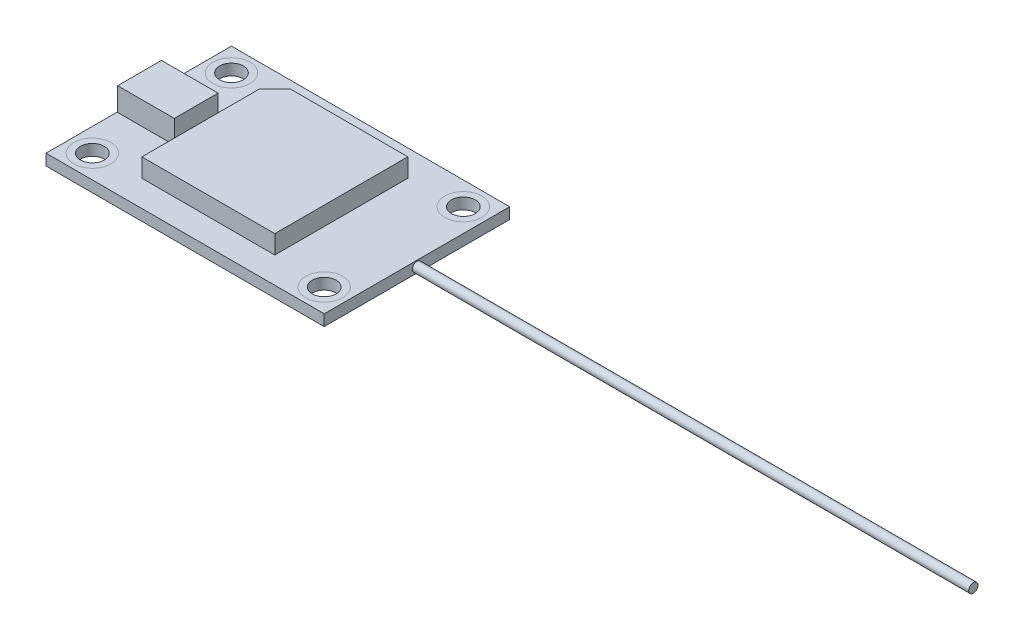
ISO-10303-21;
HEADER;
FILE_DESCRIPTION(('STEP AP214'),'2;1');
FILE_NAME('part.step','',(''),(''),'','','');
FILE_SCHEMA(('AUTOMOTIVE_DESIGN { 1 0 10303 214 1 1 1 1 }'));
ENDSEC;
DATA;
#1=APPLICATION_CONTEXT('core data for automotive mechanical design processes');
#2=APPLICATION_PROTOCOL_DEFINITION('international standard','automotive_design',2000,#1);
#3=PRODUCT_CONTEXT('',#1,'mechanical');
#4=PRODUCT('Part','Part','',(#3));
#5=PRODUCT_RELATED_PRODUCT_CATEGORY('part','',(#4));
#6=PRODUCT_DEFINITION_FORMATION('','',#4);
#7=PRODUCT_DEFINITION_CONTEXT('part definition',#1,'design');
#8=PRODUCT_DEFINITION('design','',#6,#7);
#9=PRODUCT_DEFINITION_SHAPE('','',#8);
#10=(LENGTH_UNIT() NAMED_UNIT(*) SI_UNIT(.MILLI.,.METRE.));
#11=(NAMED_UNIT(*) PLANE_ANGLE_UNIT() SI_UNIT($,.RADIAN.));
#12=(NAMED_UNIT(*) SI_UNIT($,.STERADIAN.) SOLID_ANGLE_UNIT());
#13=UNCERTAINTY_MEASURE_WITH_UNIT(LENGTH_MEASURE(1.E-05),#10,'distance_accuracy_value','');
#14=(GEOMETRIC_REPRESENTATION_CONTEXT(3) GLOBAL_UNCERTAINTY_ASSIGNED_CONTEXT((#13)) GLOBAL_UNIT_ASSIGNED_CONTEXT((#10,
#11,#12)) REPRESENTATION_CONTEXT('',''));
#15=CARTESIAN_POINT('',(0.,0.,0.));
#16=DIRECTION('',(0.,0.,1.));
#17=DIRECTION('',(1.,0.,0.));
#18=AXIS2_PLACEMENT_3D('',#15,#16,#17);
#19=CARTESIAN_POINT('',(0.,0.,0.));
#20=DIRECTION('',(0.,1.,0.));
#21=DIRECTION('',(0.,0.,1.));
#22=AXIS2_PLACEMENT_3D('',#19,#20,#21);
#23=PLANE('',#22);
#24=CARTESIAN_POINT('',(15.875,0.,9.525));
#25=DIRECTION('',(0.,1.,0.));
#26=DIRECTION('',(0.,0.,1.));
#27=AXIS2_PLACEMENT_3D('',#24,#25,#26);
#28=CIRCLE('',#27,2.54);
#29=CARTESIAN_POINT('',(15.875,0.,12.065));
#30=VERTEX_POINT('',#29);
#31=EDGE_CURVE('E314',#30,#30,#28,.F.);
#32=ORIENTED_EDGE('',*,*,#31,.F.);
#33=EDGE_LOOP('',(#32));
#34=FACE_BOUND('',#33,.T.);
#35=CARTESIAN_POINT('',(-15.875,0.,-9.525));
#36=DIRECTION('',(0.,1.,0.));
#37=DIRECTION('',(0.,0.,1.));
#38=AXIS2_PLACEMENT_3D('',#35,#36,#37);
#39=CIRCLE('',#38,2.54);
#40=CARTESIAN_POINT('',(-15.875,0.,-6.985));
#41=VERTEX_POINT('',#40);
#42=EDGE_CURVE('E298',#41,#41,#39,.F.);
#43=ORIENTED_EDGE('',*,*,#42,.F.);
#44=EDGE_LOOP('',(#43));
#45=FACE_BOUND('',#44,.T.);
#46=DIRECTION('',(0.,0.,1.));
#47=VECTOR('',#46,1.);
#48=CARTESIAN_POINT('',(-19.05,0.,12.7));
#49=LINE('',#48,#47);
#50=CARTESIAN_POINT('',(-19.05,0.,-12.7));
#51=VERTEX_POINT('',#50);
#52=CARTESIAN_POINT('',(-19.05,0.,12.7));
#53=VERTEX_POINT('',#52);
#54=EDGE_CURVE('E265',#51,#53,#49,.T.);
#55=ORIENTED_EDGE('',*,*,#54,.F.);
#56=DIRECTION('',(-1.,0.,0.));
#57=VECTOR('',#56,1.);
#58=CARTESIAN_POINT('',(19.05,0.,-12.7));
#59=LINE('',#58,#57);
#60=CARTESIAN_POINT('',(19.05,0.,-12.7));
#61=VERTEX_POINT('',#60);
#62=EDGE_CURVE('E270',#61,#51,#59,.T.);
#63=ORIENTED_EDGE('',*,*,#62,.F.);
#64=DIRECTION('',(0.,0.,-1.));
#65=VECTOR('',#64,1.);
#66=CARTESIAN_POINT('',(19.05,0.,12.7));
#67=LINE('',#66,#65);
#68=CARTESIAN_POINT('',(19.05,0.,12.7));
#69=VERTEX_POINT('',#68);
#70=EDGE_CURVE('E282',#69,#61,#67,.T.);
#71=ORIENTED_EDGE('',*,*,#70,.F.);
#72=DIRECTION('',(1.,0.,0.));
#73=VECTOR('',#72,1.);
#74=CARTESIAN_POINT('',(19.05,0.,12.7));
#75=LINE('',#74,#73);
#76=EDGE_CURVE('E280',#53,#69,#75,.T.);
#77=ORIENTED_EDGE('',*,*,#76,.F.);
#78=EDGE_LOOP('',(#55,#63,#71,#77));
#79=FACE_BOUND('',#78,.T.);
#80=CARTESIAN_POINT('',(15.875,0.,-9.525));
#81=DIRECTION('',(0.,1.,0.));
#82=DIRECTION('',(0.,0.,1.));
#83=AXIS2_PLACEMENT_3D('',#80,#81,#82);
#84=CIRCLE('',#83,2.54);
#85=CARTESIAN_POINT('',(15.875,0.,-6.985));
#86=VERTEX_POINT('',#85);
#87=EDGE_CURVE('E306',#86,#86,#84,.F.);
#88=ORIENTED_EDGE('',*,*,#87,.F.);
#89=EDGE_LOOP('',(#88));
#90=FACE_BOUND('',#89,.T.);
#91=CARTESIAN_POINT('',(-15.875,0.,9.525));
#92=DIRECTION('',(0.,1.,0.));
#93=DIRECTION('',(0.,0.,1.));
#94=AXIS2_PLACEMENT_3D('',#91,#92,#93);
#95=CIRCLE('',#94,2.54);
#96=CARTESIAN_POINT('',(-15.875,0.,12.065));
#97=VERTEX_POINT('',#96);
#98=EDGE_CURVE('E62',#97,#97,#95,.F.);
#99=ORIENTED_EDGE('',*,*,#98,.F.);
#100=EDGE_LOOP('',(#99));
#101=FACE_BOUND('',#100,.T.);
#102=ADVANCED_FACE('F53',(#34,#45,#79,#90,#101),#23,.F.);
#103=CARTESIAN_POINT('',(0.,1.524,0.));
#104=DIRECTION('',(0.,1.,0.));
#105=DIRECTION('',(0.,0.,1.));
#106=AXIS2_PLACEMENT_3D('',#103,#104,#105);
#107=PLANE('',#106);
#108=CARTESIAN_POINT('',(15.875,1.524,9.525));
#109=DIRECTION('',(0.,1.,0.));
#110=DIRECTION('',(0.,0.,1.));
#111=AXIS2_PLACEMENT_3D('',#108,#109,#110);
#112=CIRCLE('',#111,2.54);
#113=CARTESIAN_POINT('',(15.875,1.524,12.065));
#114=VERTEX_POINT('',#113);
#115=EDGE_CURVE('E310',#114,#114,#112,.F.);
#116=ORIENTED_EDGE('',*,*,#115,.T.);
#117=EDGE_LOOP('',(#116));
#118=FACE_BOUND('',#117,.T.);
#119=CARTESIAN_POINT('',(-15.875,1.524,-9.525));
#120=DIRECTION('',(0.,1.,0.));
#121=DIRECTION('',(0.,0.,1.));
#122=AXIS2_PLACEMENT_3D('',#119,#120,#121);
#123=CIRCLE('',#122,2.54);
#124=CARTESIAN_POINT('',(-15.875,1.524,-6.985));
#125=VERTEX_POINT('',#124);
#126=EDGE_CURVE('E297',#125,#125,#123,.F.);
#127=ORIENTED_EDGE('',*,*,#126,.T.);
#128=EDGE_LOOP('',(#127));
#129=FACE_BOUND('',#128,.T.);
#130=DIRECTION('',(0.,0.,-1.));
#131=VECTOR('',#130,1.);
#132=CARTESIAN_POINT('',(-18.9728058312111,1.524,0.));
#133=LINE('',#132,#131);
#134=CARTESIAN_POINT('',(-18.9728058312111,1.524,2.96555327058263));
#135=VERTEX_POINT('',#134);
#136=CARTESIAN_POINT('',(-18.9728058312111,1.524,-3.03184221883292));
#137=VERTEX_POINT('',#136);
#138=EDGE_CURVE('E158',#135,#137,#133,.T.);
#139=ORIENTED_EDGE('',*,*,#138,.T.);
#140=DIRECTION('',(1.,0.,0.));
#141=VECTOR('',#140,1.);
#142=CARTESIAN_POINT('',(0.,1.524,-3.03184221883292));
#143=LINE('',#142,#141);
#144=CARTESIAN_POINT('',(-11.2131486178344,1.524,-3.03184221883292));
#145=VERTEX_POINT('',#144);
#146=EDGE_CURVE('E173',#137,#145,#143,.T.);
#147=ORIENTED_EDGE('',*,*,#146,.T.);
#148=DIRECTION('',(0.,0.,1.));
#149=VECTOR('',#148,1.);
#150=CARTESIAN_POINT('',(-11.2131486178344,1.524,0.));
#151=LINE('',#150,#149);
#152=CARTESIAN_POINT('',(-11.2131486178344,1.524,2.96555327058263));
#153=VERTEX_POINT('',#152);
#154=EDGE_CURVE('E77',#145,#153,#151,.T.);
#155=ORIENTED_EDGE('',*,*,#154,.T.);
#156=DIRECTION('',(-1.,0.,0.));
#157=VECTOR('',#156,1.);
#158=CARTESIAN_POINT('',(0.,1.524,2.96555327058263));
#159=LINE('',#158,#157);
#160=EDGE_CURVE('E71',#153,#135,#159,.T.);
#161=ORIENTED_EDGE('',*,*,#160,.T.);
#162=EDGE_LOOP('',(#139,#147,#155,#161));
#163=FACE_BOUND('',#162,.T.);
#164=DIRECTION('',(0.,0.,1.));
#165=VECTOR('',#164,1.);
#166=CARTESIAN_POINT('',(-19.05,1.524,12.7));
#167=LINE('',#166,#165);
#168=CARTESIAN_POINT('',(-19.05,1.524,-12.7));
#169=VERTEX_POINT('',#168);
#170=CARTESIAN_POINT('',(-19.05,1.524,12.7));
#171=VERTEX_POINT('',#170);
#172=EDGE_CURVE('E266',#169,#171,#167,.T.);
#173=ORIENTED_EDGE('',*,*,#172,.T.);
#174=DIRECTION('',(1.,0.,0.));
#175=VECTOR('',#174,1.);
#176=CARTESIAN_POINT('',(19.05,1.524,12.7));
#177=LINE('',#176,#175);
#178=CARTESIAN_POINT('',(19.05,1.524,12.7));
#179=VERTEX_POINT('',#178);
#180=EDGE_CURVE('E269',#171,#179,#177,.T.);
#181=ORIENTED_EDGE('',*,*,#180,.T.);
#182=DIRECTION('',(0.,0.,-1.));
#183=VECTOR('',#182,1.);
#184=CARTESIAN_POINT('',(19.05,1.524,12.7));
#185=LINE('',#184,#183);
#186=CARTESIAN_POINT('',(19.05,1.524,-12.7));
#187=VERTEX_POINT('',#186);
#188=EDGE_CURVE('E272',#179,#187,#185,.T.);
#189=ORIENTED_EDGE('',*,*,#188,.T.);
#190=DIRECTION('',(-1.,0.,0.));
#191=VECTOR('',#190,1.);
#192=CARTESIAN_POINT('',(19.05,1.524,-12.7));
#193=LINE('',#192,#191);
#194=EDGE_CURVE('E275',#187,#169,#193,.T.);
#195=ORIENTED_EDGE('',*,*,#194,.T.);
#196=EDGE_LOOP('',(#173,#181,#189,#195));
#197=FACE_BOUND('',#196,.T.);
#198=DIRECTION('',(-0.707106781186546,0.,0.707106781186549));
#199=VECTOR('',#198,1.);
#200=CARTESIAN_POINT('',(-7.397734972714,1.524,-9.10477149478217));
#201=LINE('',#200,#199);
#202=CARTESIAN_POINT('',(-7.397734972714,1.524,-9.10477149478217));
#203=VERTEX_POINT('',#202);
#204=CARTESIAN_POINT('',(-9.50810694026553,1.524,-6.99439952723063));
#205=VERTEX_POINT('',#204);
#206=EDGE_CURVE('E212',#203,#205,#201,.T.);
#207=ORIENTED_EDGE('',*,*,#206,.F.);
#208=DIRECTION('',(-1.,0.,0.));
#209=VECTOR('',#208,1.);
#210=CARTESIAN_POINT('',(8.69547759711452,1.524,-9.10477149478217));
#211=LINE('',#210,#209);
#212=CARTESIAN_POINT('',(8.69547759711452,1.524,-9.10477149478217));
#213=VERTEX_POINT('',#212);
#214=EDGE_CURVE('E162',#213,#203,#211,.T.);
#215=ORIENTED_EDGE('',*,*,#214,.F.);
#216=DIRECTION('',(0.,0.,-1.));
#217=VECTOR('',#216,1.);
#218=CARTESIAN_POINT('',(8.69547759711452,1.524,9.11269960748051));
#219=LINE('',#218,#217);
#220=CARTESIAN_POINT('',(8.69547759711452,1.524,9.11269960748051));
#221=VERTEX_POINT('',#220);
#222=EDGE_CURVE('E201',#221,#213,#219,.T.);
#223=ORIENTED_EDGE('',*,*,#222,.F.);
#224=DIRECTION('',(1.,0.,0.));
#225=VECTOR('',#224,1.);
#226=CARTESIAN_POINT('',(-9.50810694026553,1.524,9.11269960748051));
#227=LINE('',#226,#225);
#228=CARTESIAN_POINT('',(-9.50810694026553,1.524,9.11269960748051));
#229=VERTEX_POINT('',#228);
#230=EDGE_CURVE('E217',#229,#221,#227,.T.);
#231=ORIENTED_EDGE('',*,*,#230,.F.);
#232=DIRECTION('',(0.,0.,1.));
#233=VECTOR('',#232,1.);
#234=CARTESIAN_POINT('',(-9.50810694026553,1.524,-6.99439952723063));
#235=LINE('',#234,#233);
#236=EDGE_CURVE('E214',#205,#229,#235,.T.);
#237=ORIENTED_EDGE('',*,*,#236,.F.);
#238=EDGE_LOOP('',(#207,#215,#223,#231,#237));
#239=FACE_BOUND('',#238,.T.);
#240=CARTESIAN_POINT('',(15.875,1.524,-9.525));
#241=DIRECTION('',(0.,1.,0.));
#242=DIRECTION('',(0.,0.,1.));
#243=AXIS2_PLACEMENT_3D('',#240,#241,#242);
#244=CIRCLE('',#243,2.54);
#245=CARTESIAN_POINT('',(15.875,1.524,-6.985));
#246=VERTEX_POINT('',#245);
#247=EDGE_CURVE('E302',#246,#246,#244,.F.);
#248=ORIENTED_EDGE('',*,*,#247,.T.);
#249=EDGE_LOOP('',(#248));
#250=FACE_BOUND('',#249,.T.);
#251=CARTESIAN_POINT('',(-15.875,1.524,9.525));
#252=DIRECTION('',(0.,1.,0.));
#253=DIRECTION('',(0.,0.,1.));
#254=AXIS2_PLACEMENT_3D('',#251,#252,#253);
#255=CIRCLE('',#254,2.54);
#256=CARTESIAN_POINT('',(-15.875,1.524,12.065));
#257=VERTEX_POINT('',#256);
#258=EDGE_CURVE('E318',#257,#257,#255,.F.);
#259=ORIENTED_EDGE('',*,*,#258,.T.);
#260=EDGE_LOOP('',(#259));
#261=FACE_BOUND('',#260,.T.);
#262=ADVANCED_FACE('F329',(#118,#129,#163,#197,#239,#250,#261),#107,.T.);
#263=ORIENTED_EDGE('',*,*,#98,.T.);
#264=EDGE_LOOP('',(#263));
#265=FACE_BOUND('',#264,.T.);
#266=CARTESIAN_POINT('',(-15.875,0.,9.525));
#267=DIRECTION('',(0.,1.,0.));
#268=DIRECTION('',(0.,0.,1.));
#269=AXIS2_PLACEMENT_3D('',#266,#267,#268);
#270=CIRCLE('',#269,1.63194999999999);
#271=CARTESIAN_POINT('',(-15.875,0.,11.15695));
#272=VERTEX_POINT('',#271);
#273=EDGE_CURVE('E261',#272,#272,#270,.T.);
#274=ORIENTED_EDGE('',*,*,#273,.T.);
#275=EDGE_LOOP('',(#274));
#276=FACE_BOUND('',#275,.T.);
#277=ADVANCED_FACE('F335',(#265,#276),#23,.F.);
#278=ORIENTED_EDGE('',*,*,#258,.F.);
#279=EDGE_LOOP('',(#278));
#280=FACE_BOUND('',#279,.T.);
#281=CARTESIAN_POINT('',(-15.875,1.524,9.525));
#282=DIRECTION('',(0.,1.,0.));
#283=DIRECTION('',(0.,0.,1.));
#284=AXIS2_PLACEMENT_3D('',#281,#282,#283);
#285=CIRCLE('',#284,1.63194999999999);
#286=CARTESIAN_POINT('',(-15.875,1.524,11.15695));
#287=VERTEX_POINT('',#286);
#288=EDGE_CURVE('E257',#287,#287,#285,.T.);
#289=ORIENTED_EDGE('',*,*,#288,.F.);
#290=EDGE_LOOP('',(#289));
#291=FACE_BOUND('',#290,.T.);
#292=ADVANCED_FACE('F331',(#280,#291),#107,.T.);
#293=ORIENTED_EDGE('',*,*,#31,.T.);
#294=EDGE_LOOP('',(#293));
#295=FACE_BOUND('',#294,.T.);
#296=CARTESIAN_POINT('',(15.875,0.,9.525));
#297=DIRECTION('',(0.,1.,0.));
#298=DIRECTION('',(0.,0.,1.));
#299=AXIS2_PLACEMENT_3D('',#296,#297,#298);
#300=CIRCLE('',#299,1.63195);
#301=CARTESIAN_POINT('',(15.875,0.,11.15695));
#302=VERTEX_POINT('',#301);
#303=EDGE_CURVE('E253',#302,#302,#300,.T.);
#304=ORIENTED_EDGE('',*,*,#303,.T.);
#305=EDGE_LOOP('',(#304));
#306=FACE_BOUND('',#305,.T.);
#307=ADVANCED_FACE('F334',(#295,#306),#23,.F.);
#308=ORIENTED_EDGE('',*,*,#115,.F.);
#309=EDGE_LOOP('',(#308));
#310=FACE_BOUND('',#309,.T.);
#311=CARTESIAN_POINT('',(15.875,1.524,9.525));
#312=DIRECTION('',(0.,1.,0.));
#313=DIRECTION('',(0.,0.,1.));
#314=AXIS2_PLACEMENT_3D('',#311,#312,#313);
#315=CIRCLE('',#314,1.63194999999999);
#316=CARTESIAN_POINT('',(15.875,1.524,11.15695));
#317=VERTEX_POINT('',#316);
#318=EDGE_CURVE('E249',#317,#317,#315,.T.);
#319=ORIENTED_EDGE('',*,*,#318,.F.);
#320=EDGE_LOOP('',(#319));
#321=FACE_BOUND('',#320,.T.);
#322=ADVANCED_FACE('F337',(#310,#321),#107,.T.);
#323=ORIENTED_EDGE('',*,*,#87,.T.);
#324=EDGE_LOOP('',(#323));
#325=FACE_BOUND('',#324,.T.);
#326=CARTESIAN_POINT('',(15.875,0.,-9.525));
#327=DIRECTION('',(0.,1.,0.));
#328=DIRECTION('',(0.,0.,1.));
#329=AXIS2_PLACEMENT_3D('',#326,#327,#328);
#330=CIRCLE('',#329,1.63195);
#331=CARTESIAN_POINT('',(15.875,0.,-7.89305));
#332=VERTEX_POINT('',#331);
#333=EDGE_CURVE('E246',#332,#332,#330,.T.);
#334=ORIENTED_EDGE('',*,*,#333,.T.);
#335=EDGE_LOOP('',(#334));
#336=FACE_BOUND('',#335,.T.);
#337=ADVANCED_FACE('F357',(#325,#336),#23,.F.);
#338=ORIENTED_EDGE('',*,*,#247,.F.);
#339=EDGE_LOOP('',(#338));
#340=FACE_BOUND('',#339,.T.);
#341=CARTESIAN_POINT('',(15.875,1.524,-9.525));
#342=DIRECTION('',(0.,1.,0.));
#343=DIRECTION('',(0.,0.,1.));
#344=AXIS2_PLACEMENT_3D('',#341,#342,#343);
#345=CIRCLE('',#344,1.63194999999999);
#346=CARTESIAN_POINT('',(15.875,1.524,-7.89305000000001));
#347=VERTEX_POINT('',#346);
#348=EDGE_CURVE('E243',#347,#347,#345,.T.);
#349=ORIENTED_EDGE('',*,*,#348,.F.);
#350=EDGE_LOOP('',(#349));
#351=FACE_BOUND('',#350,.T.);
#352=ADVANCED_FACE('F381',(#340,#351),#107,.T.);
#353=ORIENTED_EDGE('',*,*,#126,.F.);
#354=EDGE_LOOP('',(#353));
#355=FACE_BOUND('',#354,.T.);
#356=CARTESIAN_POINT('',(-15.875,1.524,-9.525));
#357=DIRECTION('',(0.,1.,0.));
#358=DIRECTION('',(0.,0.,1.));
#359=AXIS2_PLACEMENT_3D('',#356,#357,#358);
#360=CIRCLE('',#359,1.63194999999999);
#361=CARTESIAN_POINT('',(-15.875,1.524,-7.89305000000001));
#362=VERTEX_POINT('',#361);
#363=EDGE_CURVE('E237',#362,#362,#360,.T.);
#364=ORIENTED_EDGE('',*,*,#363,.F.);
#365=EDGE_LOOP('',(#364));
#366=FACE_BOUND('',#365,.T.);
#367=ADVANCED_FACE('F366',(#355,#366),#107,.T.);
#368=CARTESIAN_POINT('',(-19.05,1.524,12.7));
#369=DIRECTION('',(1.,0.,0.));
#370=DIRECTION('',(0.,0.,-1.));
#371=AXIS2_PLACEMENT_3D('',#368,#369,#370);
#372=PLANE('',#371);
#373=ORIENTED_EDGE('',*,*,#54,.T.);
#374=DIRECTION('',(0.,-1.,0.));
#375=VECTOR('',#374,1.);
#376=CARTESIAN_POINT('',(-19.05,1.524,12.7));
#377=LINE('',#376,#375);
#378=EDGE_CURVE('E294',#171,#53,#377,.T.);
#379=ORIENTED_EDGE('',*,*,#378,.F.);
#380=ORIENTED_EDGE('',*,*,#172,.F.);
#381=DIRECTION('',(0.,-1.,0.));
#382=VECTOR('',#381,1.);
#383=CARTESIAN_POINT('',(-19.05,1.524,-12.7));
#384=LINE('',#383,#382);
#385=EDGE_CURVE('E277',#169,#51,#384,.T.);
#386=ORIENTED_EDGE('',*,*,#385,.T.);
#387=EDGE_LOOP('',(#373,#379,#380,#386));
#388=FACE_BOUND('',#387,.T.);
#389=ADVANCED_FACE('F55',(#388),#372,.F.);
#390=CARTESIAN_POINT('',(19.05,1.524,12.7));
#391=DIRECTION('',(0.,0.,-1.));
#392=DIRECTION('',(-1.,0.,0.));
#393=AXIS2_PLACEMENT_3D('',#390,#391,#392);
#394=PLANE('',#393);
#395=ORIENTED_EDGE('',*,*,#76,.T.);
#396=DIRECTION('',(0.,-1.,0.));
#397=VECTOR('',#396,1.);
#398=CARTESIAN_POINT('',(19.05,1.524,12.7));
#399=LINE('',#398,#397);
#400=EDGE_CURVE('E291',#179,#69,#399,.T.);
#401=ORIENTED_EDGE('',*,*,#400,.F.);
#402=ORIENTED_EDGE('',*,*,#180,.F.);
#403=ORIENTED_EDGE('',*,*,#378,.T.);
#404=EDGE_LOOP('',(#395,#401,#402,#403));
#405=FACE_BOUND('',#404,.T.);
#406=ADVANCED_FACE('F460',(#405),#394,.F.);
#407=CARTESIAN_POINT('',(19.05,1.524,12.7));
#408=DIRECTION('',(-1.,0.,0.));
#409=DIRECTION('',(0.,0.,1.));
#410=AXIS2_PLACEMENT_3D('',#407,#408,#409);
#411=PLANE('',#410);
#412=CARTESIAN_POINT('',(19.05,0.762,0.));
#413=DIRECTION('',(-1.,0.,0.));
#414=DIRECTION('',(0.,0.,1.));
#415=AXIS2_PLACEMENT_3D('',#412,#413,#414);
#416=CIRCLE('',#415,0.635);
#417=CARTESIAN_POINT('',(19.05,0.762,0.634999999999997));
#418=VERTEX_POINT('',#417);
#419=EDGE_CURVE('E11',#418,#418,#416,.F.);
#420=ORIENTED_EDGE('',*,*,#419,.F.);
#421=EDGE_LOOP('',(#420));
#422=FACE_BOUND('',#421,.T.);
#423=ORIENTED_EDGE('',*,*,#70,.T.);
#424=DIRECTION('',(0.,-1.,0.));
#425=VECTOR('',#424,1.);
#426=CARTESIAN_POINT('',(19.05,1.524,-12.7));
#427=LINE('',#426,#425);
#428=EDGE_CURVE('E288',#187,#61,#427,.T.);
#429=ORIENTED_EDGE('',*,*,#428,.F.);
#430=ORIENTED_EDGE('',*,*,#188,.F.);
#431=ORIENTED_EDGE('',*,*,#400,.T.);
#432=EDGE_LOOP('',(#423,#429,#430,#431));
#433=FACE_BOUND('',#432,.T.);
#434=ADVANCED_FACE('F457',(#422,#433),#411,.F.);
#435=CARTESIAN_POINT('',(19.05,1.524,-12.7));
#436=DIRECTION('',(0.,0.,1.));
#437=DIRECTION('',(1.,0.,0.));
#438=AXIS2_PLACEMENT_3D('',#435,#436,#437);
#439=PLANE('',#438);
#440=ORIENTED_EDGE('',*,*,#62,.T.);
#441=ORIENTED_EDGE('',*,*,#385,.F.);
#442=ORIENTED_EDGE('',*,*,#194,.F.);
#443=ORIENTED_EDGE('',*,*,#428,.T.);
#444=EDGE_LOOP('',(#440,#441,#442,#443));
#445=FACE_BOUND('',#444,.T.);
#446=ADVANCED_FACE('F354',(#445),#439,.F.);
#447=ORIENTED_EDGE('',*,*,#42,.T.);
#448=EDGE_LOOP('',(#447));
#449=FACE_BOUND('',#448,.T.);
#450=CARTESIAN_POINT('',(-15.875,0.,-9.525));
#451=DIRECTION('',(0.,1.,0.));
#452=DIRECTION('',(0.,0.,1.));
#453=AXIS2_PLACEMENT_3D('',#450,#451,#452);
#454=CIRCLE('',#453,1.63194999999999);
#455=CARTESIAN_POINT('',(-15.875,0.,-7.89305000000001));
#456=VERTEX_POINT('',#455);
#457=EDGE_CURVE('E240',#456,#456,#454,.T.);
#458=ORIENTED_EDGE('',*,*,#457,.T.);
#459=EDGE_LOOP('',(#458));
#460=FACE_BOUND('',#459,.T.);
#461=ADVANCED_FACE('F343',(#449,#460),#23,.F.);
#462=CARTESIAN_POINT('',(-15.875,1.524,9.525));
#463=DIRECTION('',(0.,1.,0.));
#464=DIRECTION('',(0.,0.,1.));
#465=AXIS2_PLACEMENT_3D('',#462,#463,#464);
#466=CYLINDRICAL_SURFACE('',#465,1.63194999999999);
#467=ORIENTED_EDGE('',*,*,#273,.F.);
#468=EDGE_LOOP('',(#467));
#469=FACE_BOUND('',#468,.T.);
#470=ORIENTED_EDGE('',*,*,#288,.T.);
#471=EDGE_LOOP('',(#470));
#472=FACE_BOUND('',#471,.T.);
#473=ADVANCED_FACE('F340',(#469,#472),#466,.F.);
#474=CARTESIAN_POINT('',(15.875,1.524,9.525));
#475=DIRECTION('',(0.,1.,0.));
#476=DIRECTION('',(0.,0.,1.));
#477=AXIS2_PLACEMENT_3D('',#474,#475,#476);
#478=CYLINDRICAL_SURFACE('',#477,1.63194999999999);
#479=ORIENTED_EDGE('',*,*,#303,.F.);
#480=EDGE_LOOP('',(#479));
#481=FACE_BOUND('',#480,.T.);
#482=ORIENTED_EDGE('',*,*,#318,.T.);
#483=EDGE_LOOP('',(#482));
#484=FACE_BOUND('',#483,.T.);
#485=ADVANCED_FACE('F342',(#481,#484),#478,.F.);
#486=CARTESIAN_POINT('',(15.875,1.524,-9.525));
#487=DIRECTION('',(0.,1.,0.));
#488=DIRECTION('',(0.,0.,1.));
#489=AXIS2_PLACEMENT_3D('',#486,#487,#488);
#490=CYLINDRICAL_SURFACE('',#489,1.63194999999999);
#491=ORIENTED_EDGE('',*,*,#333,.F.);
#492=EDGE_LOOP('',(#491));
#493=FACE_BOUND('',#492,.T.);
#494=ORIENTED_EDGE('',*,*,#348,.T.);
#495=EDGE_LOOP('',(#494));
#496=FACE_BOUND('',#495,.T.);
#497=ADVANCED_FACE('F350',(#493,#496),#490,.F.);
#498=CARTESIAN_POINT('',(-15.875,1.524,-9.525));
#499=DIRECTION('',(0.,1.,0.));
#500=DIRECTION('',(0.,0.,1.));
#501=AXIS2_PLACEMENT_3D('',#498,#499,#500);
#502=CYLINDRICAL_SURFACE('',#501,1.63194999999999);
#503=ORIENTED_EDGE('',*,*,#457,.F.);
#504=EDGE_LOOP('',(#503));
#505=FACE_BOUND('',#504,.T.);
#506=ORIENTED_EDGE('',*,*,#363,.T.);
#507=EDGE_LOOP('',(#506));
#508=FACE_BOUND('',#507,.T.);
#509=ADVANCED_FACE('F395',(#505,#508),#502,.F.);
#510=CARTESIAN_POINT('',(8.69547759711452,4.064,-9.10477149478217));
#511=DIRECTION('',(0.,0.,1.));
#512=DIRECTION('',(1.,0.,0.));
#513=AXIS2_PLACEMENT_3D('',#510,#511,#512);
#514=PLANE('',#513);
#515=ORIENTED_EDGE('',*,*,#214,.T.);
#516=DIRECTION('',(0.,-1.,0.));
#517=VECTOR('',#516,1.);
#518=CARTESIAN_POINT('',(-7.397734972714,4.064,-9.10477149478217));
#519=LINE('',#518,#517);
#520=CARTESIAN_POINT('',(-7.397734972714,4.064,-9.10477149478217));
#521=VERTEX_POINT('',#520);
#522=EDGE_CURVE('E235',#521,#203,#519,.T.);
#523=ORIENTED_EDGE('',*,*,#522,.F.);
#524=DIRECTION('',(-1.,0.,0.));
#525=VECTOR('',#524,1.);
#526=CARTESIAN_POINT('',(8.69547759711452,4.064,-9.10477149478217));
#527=LINE('',#526,#525);
#528=CARTESIAN_POINT('',(8.69547759711452,4.064,-9.10477149478217));
#529=VERTEX_POINT('',#528);
#530=EDGE_CURVE('E197',#529,#521,#527,.T.);
#531=ORIENTED_EDGE('',*,*,#530,.F.);
#532=DIRECTION('',(0.,-1.,0.));
#533=VECTOR('',#532,1.);
#534=CARTESIAN_POINT('',(8.69547759711452,4.064,-9.10477149478217));
#535=LINE('',#534,#533);
#536=EDGE_CURVE('E209',#529,#213,#535,.T.);
#537=ORIENTED_EDGE('',*,*,#536,.T.);
#538=EDGE_LOOP('',(#515,#523,#531,#537));
#539=FACE_BOUND('',#538,.T.);
#540=ADVANCED_FACE('F402',(#539),#514,.F.);
#541=CARTESIAN_POINT('',(-7.397734972714,4.064,-9.10477149478217));
#542=DIRECTION('',(0.707106781186549,0.,0.707106781186546));
#543=DIRECTION('',(0.707106781186546,0.,-0.707106781186549));
#544=AXIS2_PLACEMENT_3D('',#541,#542,#543);
#545=PLANE('',#544);
#546=ORIENTED_EDGE('',*,*,#206,.T.);
#547=DIRECTION('',(0.,-1.,0.));
#548=VECTOR('',#547,1.);
#549=CARTESIAN_POINT('',(-9.50810694026553,4.064,-6.99439952723063));
#550=LINE('',#549,#548);
#551=CARTESIAN_POINT('',(-9.50810694026553,4.064,-6.99439952723063));
#552=VERTEX_POINT('',#551);
#553=EDGE_CURVE('E232',#552,#205,#550,.T.);
#554=ORIENTED_EDGE('',*,*,#553,.F.);
#555=DIRECTION('',(-0.707106781186546,0.,0.707106781186549));
#556=VECTOR('',#555,1.);
#557=CARTESIAN_POINT('',(-7.397734972714,4.064,-9.10477149478217));
#558=LINE('',#557,#556);
#559=EDGE_CURVE('E200',#521,#552,#558,.T.);
#560=ORIENTED_EDGE('',*,*,#559,.F.);
#561=ORIENTED_EDGE('',*,*,#522,.T.);
#562=EDGE_LOOP('',(#546,#554,#560,#561));
#563=FACE_BOUND('',#562,.T.);
#564=ADVANCED_FACE('F408',(#563),#545,.F.);
#565=CARTESIAN_POINT('',(-9.50810694026553,4.064,-6.99439952723063));
#566=DIRECTION('',(1.,0.,0.));
#567=DIRECTION('',(0.,0.,-1.));
#568=AXIS2_PLACEMENT_3D('',#565,#566,#567);
#569=PLANE('',#568);
#570=ORIENTED_EDGE('',*,*,#236,.T.);
#571=DIRECTION('',(0.,-1.,0.));
#572=VECTOR('',#571,1.);
#573=CARTESIAN_POINT('',(-9.50810694026553,4.064,9.11269960748051));
#574=LINE('',#573,#572);
#575=CARTESIAN_POINT('',(-9.50810694026553,4.064,9.11269960748051));
#576=VERTEX_POINT('',#575);
#577=EDGE_CURVE('E228',#576,#229,#574,.T.);
#578=ORIENTED_EDGE('',*,*,#577,.F.);
#579=DIRECTION('',(0.,0.,1.));
#580=VECTOR('',#579,1.);
#581=CARTESIAN_POINT('',(-9.50810694026553,4.064,-6.99439952723063));
#582=LINE('',#581,#580);
#583=EDGE_CURVE('E203',#552,#576,#582,.T.);
#584=ORIENTED_EDGE('',*,*,#583,.F.);
#585=ORIENTED_EDGE('',*,*,#553,.T.);
#586=EDGE_LOOP('',(#570,#578,#584,#585));
#587=FACE_BOUND('',#586,.T.);
#588=ADVANCED_FACE('F412',(#587),#569,.F.);
#589=CARTESIAN_POINT('',(-9.50810694026553,4.064,9.11269960748051));
#590=DIRECTION('',(0.,0.,-1.));
#591=DIRECTION('',(-1.,0.,0.));
#592=AXIS2_PLACEMENT_3D('',#589,#590,#591);
#593=PLANE('',#592);
#594=ORIENTED_EDGE('',*,*,#230,.T.);
#595=DIRECTION('',(0.,-1.,0.));
#596=VECTOR('',#595,1.);
#597=CARTESIAN_POINT('',(8.69547759711452,4.064,9.11269960748051));
#598=LINE('',#597,#596);
#599=CARTESIAN_POINT('',(8.69547759711452,4.064,9.11269960748051));
#600=VERTEX_POINT('',#599);
#601=EDGE_CURVE('E225',#600,#221,#598,.T.);
#602=ORIENTED_EDGE('',*,*,#601,.F.);
#603=DIRECTION('',(1.,0.,0.));
#604=VECTOR('',#603,1.);
#605=CARTESIAN_POINT('',(-9.50810694026553,4.064,9.11269960748051));
#606=LINE('',#605,#604);
#607=EDGE_CURVE('E205',#576,#600,#606,.T.);
#608=ORIENTED_EDGE('',*,*,#607,.F.);
#609=ORIENTED_EDGE('',*,*,#577,.T.);
#610=EDGE_LOOP('',(#594,#602,#608,#609));
#611=FACE_BOUND('',#610,.T.);
#612=ADVANCED_FACE('F416',(#611),#593,.F.);
#613=CARTESIAN_POINT('',(8.69547759711452,4.064,9.11269960748051));
#614=DIRECTION('',(-1.,0.,0.));
#615=DIRECTION('',(0.,0.,1.));
#616=AXIS2_PLACEMENT_3D('',#613,#614,#615);
#617=PLANE('',#616);
#618=ORIENTED_EDGE('',*,*,#222,.T.);
#619=ORIENTED_EDGE('',*,*,#536,.F.);
#620=DIRECTION('',(0.,0.,-1.));
#621=VECTOR('',#620,1.);
#622=CARTESIAN_POINT('',(8.69547759711452,4.064,9.11269960748051));
#623=LINE('',#622,#621);
#624=EDGE_CURVE('E207',#600,#529,#623,.T.);
#625=ORIENTED_EDGE('',*,*,#624,.F.);
#626=ORIENTED_EDGE('',*,*,#601,.T.);
#627=EDGE_LOOP('',(#618,#619,#625,#626));
#628=FACE_BOUND('',#627,.T.);
#629=ADVANCED_FACE('F420',(#628),#617,.F.);
#630=CARTESIAN_POINT('',(0.,4.064,0.));
#631=DIRECTION('',(0.,1.,0.));
#632=DIRECTION('',(0.,0.,1.));
#633=AXIS2_PLACEMENT_3D('',#630,#631,#632);
#634=PLANE('',#633);
#635=ORIENTED_EDGE('',*,*,#530,.T.);
#636=ORIENTED_EDGE('',*,*,#559,.T.);
#637=ORIENTED_EDGE('',*,*,#583,.T.);
#638=ORIENTED_EDGE('',*,*,#607,.T.);
#639=ORIENTED_EDGE('',*,*,#624,.T.);
#640=EDGE_LOOP('',(#635,#636,#637,#638,#639));
#641=FACE_BOUND('',#640,.T.);
#642=ADVANCED_FACE('F424',(#641),#634,.T.);
#643=CARTESIAN_POINT('',(-18.9728058312111,4.699,0.));
#644=DIRECTION('',(-1.,0.,0.));
#645=DIRECTION('',(0.,0.,1.));
#646=AXIS2_PLACEMENT_3D('',#643,#644,#645);
#647=PLANE('',#646);
#648=ORIENTED_EDGE('',*,*,#138,.F.);
#649=DIRECTION('',(0.,-1.,0.));
#650=VECTOR('',#649,1.);
#651=CARTESIAN_POINT('',(-18.9728058312111,4.699,2.96555327058263));
#652=LINE('',#651,#650);
#653=CARTESIAN_POINT('',(-18.9728058312111,4.699,2.96555327058263));
#654=VERTEX_POINT('',#653);
#655=EDGE_CURVE('E152',#654,#135,#652,.T.);
#656=ORIENTED_EDGE('',*,*,#655,.F.);
#657=DIRECTION('',(0.,0.,-1.));
#658=VECTOR('',#657,1.);
#659=CARTESIAN_POINT('',(-18.9728058312111,4.699,0.));
#660=LINE('',#659,#658);
#661=CARTESIAN_POINT('',(-18.9728058312111,4.699,-3.03184221883292));
#662=VERTEX_POINT('',#661);
#663=EDGE_CURVE('E156',#654,#662,#660,.T.);
#664=ORIENTED_EDGE('',*,*,#663,.T.);
#665=DIRECTION('',(0.,-1.,0.));
#666=VECTOR('',#665,1.);
#667=CARTESIAN_POINT('',(-18.9728058312111,4.699,-3.03184221883292));
#668=LINE('',#667,#666);
#669=EDGE_CURVE('E182',#662,#137,#668,.T.);
#670=ORIENTED_EDGE('',*,*,#669,.T.);
#671=EDGE_LOOP('',(#648,#656,#664,#670));
#672=FACE_BOUND('',#671,.T.);
#673=ADVANCED_FACE('F154',(#672),#647,.T.);
#674=CARTESIAN_POINT('',(0.,4.699,2.96555327058263));
#675=DIRECTION('',(0.,0.,1.));
#676=DIRECTION('',(1.,0.,0.));
#677=AXIS2_PLACEMENT_3D('',#674,#675,#676);
#678=PLANE('',#677);
#679=ORIENTED_EDGE('',*,*,#160,.F.);
#680=DIRECTION('',(0.,-1.,0.));
#681=VECTOR('',#680,1.);
#682=CARTESIAN_POINT('',(-11.2131486178344,4.699,2.96555327058263));
#683=LINE('',#682,#681);
#684=CARTESIAN_POINT('',(-11.2131486178344,4.699,2.96555327058263));
#685=VERTEX_POINT('',#684);
#686=EDGE_CURVE('E163',#685,#153,#683,.T.);
#687=ORIENTED_EDGE('',*,*,#686,.F.);
#688=DIRECTION('',(-1.,0.,0.));
#689=VECTOR('',#688,1.);
#690=CARTESIAN_POINT('',(0.,4.699,2.96555327058263));
#691=LINE('',#690,#689);
#692=EDGE_CURVE('E169',#685,#654,#691,.T.);
#693=ORIENTED_EDGE('',*,*,#692,.T.);
#694=ORIENTED_EDGE('',*,*,#655,.T.);
#695=EDGE_LOOP('',(#679,#687,#693,#694));
#696=FACE_BOUND('',#695,.T.);
#697=ADVANCED_FACE('F175',(#696),#678,.T.);
#698=CARTESIAN_POINT('',(-11.2131486178344,4.699,0.));
#699=DIRECTION('',(1.,0.,0.));
#700=DIRECTION('',(0.,0.,-1.));
#701=AXIS2_PLACEMENT_3D('',#698,#699,#700);
#702=PLANE('',#701);
#703=ORIENTED_EDGE('',*,*,#154,.F.);
#704=DIRECTION('',(0.,-1.,0.));
#705=VECTOR('',#704,1.);
#706=CARTESIAN_POINT('',(-11.2131486178344,4.699,-3.03184221883292));
#707=LINE('',#706,#705);
#708=CARTESIAN_POINT('',(-11.2131486178344,4.699,-3.03184221883292));
#709=VERTEX_POINT('',#708);
#710=EDGE_CURVE('E192',#709,#145,#707,.T.);
#711=ORIENTED_EDGE('',*,*,#710,.F.);
#712=DIRECTION('',(0.,0.,1.));
#713=VECTOR('',#712,1.);
#714=CARTESIAN_POINT('',(-11.2131486178344,4.699,0.));
#715=LINE('',#714,#713);
#716=EDGE_CURVE('E176',#709,#685,#715,.T.);
#717=ORIENTED_EDGE('',*,*,#716,.T.);
#718=ORIENTED_EDGE('',*,*,#686,.T.);
#719=EDGE_LOOP('',(#703,#711,#717,#718));
#720=FACE_BOUND('',#719,.T.);
#721=ADVANCED_FACE('F433',(#720),#702,.T.);
#722=CARTESIAN_POINT('',(0.,4.699,-3.03184221883292));
#723=DIRECTION('',(0.,0.,-1.));
#724=DIRECTION('',(-1.,0.,0.));
#725=AXIS2_PLACEMENT_3D('',#722,#723,#724);
#726=PLANE('',#725);
#727=ORIENTED_EDGE('',*,*,#146,.F.);
#728=ORIENTED_EDGE('',*,*,#669,.F.);
#729=DIRECTION('',(1.,0.,0.));
#730=VECTOR('',#729,1.);
#731=CARTESIAN_POINT('',(0.,4.699,-3.03184221883292));
#732=LINE('',#731,#730);
#733=EDGE_CURVE('E172',#662,#709,#732,.T.);
#734=ORIENTED_EDGE('',*,*,#733,.T.);
#735=ORIENTED_EDGE('',*,*,#710,.T.);
#736=EDGE_LOOP('',(#727,#728,#734,#735));
#737=FACE_BOUND('',#736,.T.);
#738=ADVANCED_FACE('F436',(#737),#726,.T.);
#739=CARTESIAN_POINT('',(0.,4.699,0.));
#740=DIRECTION('',(0.,1.,0.));
#741=DIRECTION('',(0.,0.,1.));
#742=AXIS2_PLACEMENT_3D('',#739,#740,#741);
#743=PLANE('',#742);
#744=ORIENTED_EDGE('',*,*,#663,.F.);
#745=ORIENTED_EDGE('',*,*,#692,.F.);
#746=ORIENTED_EDGE('',*,*,#716,.F.);
#747=ORIENTED_EDGE('',*,*,#733,.F.);
#748=EDGE_LOOP('',(#744,#745,#746,#747));
#749=FACE_BOUND('',#748,.T.);
#750=ADVANCED_FACE('F167',(#749),#743,.T.);
#751=CARTESIAN_POINT('',(95.25,0.762,0.));
#752=DIRECTION('',(-1.,0.,0.));
#753=DIRECTION('',(0.,0.,1.));
#754=AXIS2_PLACEMENT_3D('',#751,#752,#753);
#755=CYLINDRICAL_SURFACE('',#754,0.635);
#756=CARTESIAN_POINT('',(95.25,0.762,0.));
#757=DIRECTION('',(1.,0.,0.));
#758=DIRECTION('',(0.,0.,-1.));
#759=AXIS2_PLACEMENT_3D('',#756,#757,#758);
#760=CIRCLE('',#759,0.635);
#761=CARTESIAN_POINT('',(95.25,0.762,-0.635000000000013));
#762=VERTEX_POINT('',#761);
#763=EDGE_CURVE('E185',#762,#762,#760,.T.);
#764=ORIENTED_EDGE('',*,*,#763,.F.);
#765=EDGE_LOOP('',(#764));
#766=FACE_BOUND('',#765,.T.);
#767=ORIENTED_EDGE('',*,*,#419,.T.);
#768=EDGE_LOOP('',(#767));
#769=FACE_BOUND('',#768,.T.);
#770=ADVANCED_FACE('F443',(#766,#769),#755,.T.);
#771=CARTESIAN_POINT('',(95.25,0.762,0.));
#772=DIRECTION('',(1.,0.,0.));
#773=DIRECTION('',(0.,0.,-1.));
#774=AXIS2_PLACEMENT_3D('',#771,#772,#773);
#775=PLANE('',#774);
#776=ORIENTED_EDGE('',*,*,#763,.T.);
#777=EDGE_LOOP('',(#776));
#778=FACE_BOUND('',#777,.T.);
#779=ADVANCED_FACE('F446',(#778),#775,.T.);
#780=CLOSED_SHELL('',(#102,#262,#277,#292,#307,#322,#337,#352,#367,#389,#406,#434,#446,#461,
#473,#485,#497,#509,#540,#564,#588,#612,#629,#642,#673,#697,#721,#738,#750,#770,#779));
#781=MANIFOLD_SOLID_BREP('B2',#780);
#782=ADVANCED_BREP_SHAPE_REPRESENTATION('',(#18,#781),#14);
#783=SHAPE_DEFINITION_REPRESENTATION(#9,#782);
ENDSEC;
END-ISO-10303-21;
